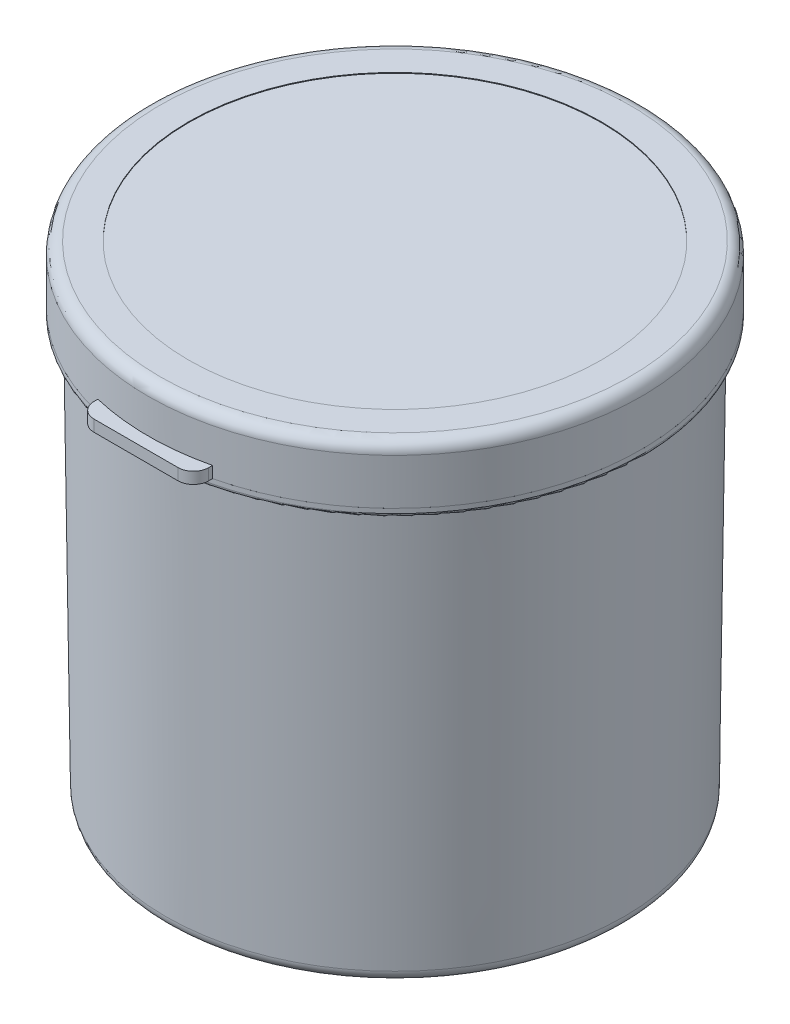
ISO-10303-21;
HEADER;
FILE_DESCRIPTION(('STEP AP214'),'2;1');
FILE_NAME('part.step','',(''),(''),'','','');
FILE_SCHEMA(('AUTOMOTIVE_DESIGN { 1 0 10303 214 1 1 1 1 }'));
ENDSEC;
DATA;
#1=APPLICATION_CONTEXT('core data for automotive mechanical design processes');
#2=APPLICATION_PROTOCOL_DEFINITION('international standard','automotive_design',2000,#1);
#3=PRODUCT_CONTEXT('',#1,'mechanical');
#4=PRODUCT('Part','Part','',(#3));
#5=PRODUCT_RELATED_PRODUCT_CATEGORY('part','',(#4));
#6=PRODUCT_DEFINITION_FORMATION('','',#4);
#7=PRODUCT_DEFINITION_CONTEXT('part definition',#1,'design');
#8=PRODUCT_DEFINITION('design','',#6,#7);
#9=PRODUCT_DEFINITION_SHAPE('','',#8);
#10=(LENGTH_UNIT() NAMED_UNIT(*) SI_UNIT(.MILLI.,.METRE.));
#11=(NAMED_UNIT(*) PLANE_ANGLE_UNIT() SI_UNIT($,.RADIAN.));
#12=(NAMED_UNIT(*) SI_UNIT($,.STERADIAN.) SOLID_ANGLE_UNIT());
#13=UNCERTAINTY_MEASURE_WITH_UNIT(LENGTH_MEASURE(1.E-05),#10,'distance_accuracy_value','');
#14=(GEOMETRIC_REPRESENTATION_CONTEXT(3) GLOBAL_UNCERTAINTY_ASSIGNED_CONTEXT((#13)) GLOBAL_UNIT_ASSIGNED_CONTEXT((#10,
#11,#12)) REPRESENTATION_CONTEXT('',''));
#15=CARTESIAN_POINT('',(0.,0.,0.));
#16=DIRECTION('',(0.,0.,1.));
#17=DIRECTION('',(1.,0.,0.));
#18=AXIS2_PLACEMENT_3D('',#15,#16,#17);
#19=CARTESIAN_POINT('',(0.,60.5,0.));
#20=DIRECTION('',(0.,1.,0.));
#21=DIRECTION('',(0.,0.,1.));
#22=AXIS2_PLACEMENT_3D('',#19,#20,#21);
#23=PLANE('',#22);
#24=CARTESIAN_POINT('',(0.,60.5,0.));
#25=DIRECTION('',(0.,1.,0.));
#26=DIRECTION('',(0.,0.,1.));
#27=AXIS2_PLACEMENT_3D('',#24,#25,#26);
#28=CIRCLE('',#27,30.6512169002747);
#29=CARTESIAN_POINT('',(0.,60.5,30.6512169002747));
#30=VERTEX_POINT('',#29);
#31=EDGE_CURVE('P0_E24',#30,#30,#28,.T.);
#32=ORIENTED_EDGE('',*,*,#31,.T.);
#33=EDGE_LOOP('',(#32));
#34=FACE_BOUND('',#33,.T.);
#35=CARTESIAN_POINT('',(0.,60.5,0.));
#36=DIRECTION('',(0.,1.,0.));
#37=DIRECTION('',(0.,0.,1.));
#38=AXIS2_PLACEMENT_3D('',#35,#36,#37);
#39=CIRCLE('',#38,29.7499231639382);
#40=CARTESIAN_POINT('',(0.,60.5,29.7499231639382));
#41=VERTEX_POINT('',#40);
#42=EDGE_CURVE('P0_E58',#41,#41,#39,.T.);
#43=ORIENTED_EDGE('',*,*,#42,.F.);
#44=EDGE_LOOP('',(#43));
#45=FACE_BOUND('',#44,.T.);
#46=ADVANCED_FACE('P0_F17',(#34,#45),#23,.T.);
#47=CARTESIAN_POINT('',(0.,0.,0.));
#48=DIRECTION('',(0.,1.,0.));
#49=DIRECTION('',(0.,0.,1.));
#50=AXIS2_PLACEMENT_3D('',#47,#48,#49);
#51=CONICAL_SURFACE('',#50,30.,0.0123960592402527);
#52=CARTESIAN_POINT('',(0.,60.400007683016,0.));
#53=DIRECTION('',(0.,-1.,0.));
#54=DIRECTION('',(0.,0.,-1.));
#55=AXIS2_PLACEMENT_3D('',#52,#53,#54);
#56=CIRCLE('',#55,30.7487604258225);
#57=CARTESIAN_POINT('',(0.,60.400007683016,-30.7487604258225));
#58=VERTEX_POINT('',#57);
#59=EDGE_CURVE('P0_E11',#58,#58,#56,.T.);
#60=ORIENTED_EDGE('',*,*,#59,.T.);
#61=EDGE_LOOP('',(#60));
#62=FACE_BOUND('',#61,.T.);
#63=CARTESIAN_POINT('',(0.,55.5,0.));
#64=DIRECTION('',(0.,1.,0.));
#65=DIRECTION('',(0.,0.,1.));
#66=AXIS2_PLACEMENT_3D('',#63,#64,#65);
#67=CIRCLE('',#66,30.6880165289256);
#68=CARTESIAN_POINT('',(0.,55.5,30.6880165289256));
#69=VERTEX_POINT('',#68);
#70=EDGE_CURVE('P0_E49',#69,#69,#67,.F.);
#71=ORIENTED_EDGE('',*,*,#70,.F.);
#72=EDGE_LOOP('',(#71));
#73=FACE_BOUND('',#72,.T.);
#74=ADVANCED_FACE('P0_F65',(#62,#73),#51,.T.);
#75=CARTESIAN_POINT('',(0.,55.5,0.));
#76=DIRECTION('',(0.,-1.,0.));
#77=DIRECTION('',(0.,0.,-1.));
#78=AXIS2_PLACEMENT_3D('',#75,#76,#77);
#79=CYLINDRICAL_SURFACE('',#78,32.25);
#80=CARTESIAN_POINT('',(0.,54.9,0.));
#81=DIRECTION('',(0.,1.,0.));
#82=DIRECTION('',(0.,0.,1.));
#83=AXIS2_PLACEMENT_3D('',#80,#81,#82);
#84=CIRCLE('',#83,32.25);
#85=CARTESIAN_POINT('',(0.,54.9,32.25));
#86=VERTEX_POINT('',#85);
#87=EDGE_CURVE('P0_E40',#86,#86,#84,.T.);
#88=ORIENTED_EDGE('',*,*,#87,.T.);
#89=EDGE_LOOP('',(#88));
#90=FACE_BOUND('',#89,.T.);
#91=CARTESIAN_POINT('',(0.,55.5,0.));
#92=DIRECTION('',(0.,1.,0.));
#93=DIRECTION('',(0.,0.,1.));
#94=AXIS2_PLACEMENT_3D('',#91,#92,#93);
#95=CIRCLE('',#94,32.25);
#96=CARTESIAN_POINT('',(0.,55.5,32.25));
#97=VERTEX_POINT('',#96);
#98=EDGE_CURVE('P0_E55',#97,#97,#95,.T.);
#99=ORIENTED_EDGE('',*,*,#98,.F.);
#100=EDGE_LOOP('',(#99));
#101=FACE_BOUND('',#100,.T.);
#102=ADVANCED_FACE('P0_F71',(#90,#101),#79,.T.);
#103=CARTESIAN_POINT('',(0.,55.5,0.));
#104=DIRECTION('',(0.,1.,0.));
#105=DIRECTION('',(0.,0.,1.));
#106=AXIS2_PLACEMENT_3D('',#103,#104,#105);
#107=PLANE('',#106);
#108=ORIENTED_EDGE('',*,*,#70,.T.);
#109=EDGE_LOOP('',(#108));
#110=FACE_BOUND('',#109,.T.);
#111=ORIENTED_EDGE('',*,*,#98,.T.);
#112=EDGE_LOOP('',(#111));
#113=FACE_BOUND('',#112,.T.);
#114=ADVANCED_FACE('P0_F102',(#110,#113),#107,.T.);
#115=CARTESIAN_POINT('',(0.,54.4,0.));
#116=DIRECTION('',(0.,1.,0.));
#117=DIRECTION('',(0.,0.,1.));
#118=AXIS2_PLACEMENT_3D('',#115,#116,#117);
#119=PLANE('',#118);
#120=CARTESIAN_POINT('',(0.,54.4,0.));
#121=DIRECTION('',(0.,1.,0.));
#122=DIRECTION('',(0.,0.,1.));
#123=AXIS2_PLACEMENT_3D('',#120,#121,#122);
#124=CIRCLE('',#123,31.75);
#125=CARTESIAN_POINT('',(0.,54.4,31.75));
#126=VERTEX_POINT('',#125);
#127=EDGE_CURVE('P0_E37',#126,#126,#124,.F.);
#128=ORIENTED_EDGE('',*,*,#127,.T.);
#129=EDGE_LOOP('',(#128));
#130=FACE_BOUND('',#129,.T.);
#131=CARTESIAN_POINT('',(0.,54.4,0.));
#132=DIRECTION('',(0.,1.,0.));
#133=DIRECTION('',(0.,0.,1.));
#134=AXIS2_PLACEMENT_3D('',#131,#132,#133);
#135=CIRCLE('',#134,30.6743801652893);
#136=CARTESIAN_POINT('',(0.,54.4,30.6743801652893));
#137=VERTEX_POINT('',#136);
#138=EDGE_CURVE('P0_E52',#137,#137,#135,.F.);
#139=ORIENTED_EDGE('',*,*,#138,.F.);
#140=EDGE_LOOP('',(#139));
#141=FACE_BOUND('',#140,.T.);
#142=ADVANCED_FACE('P0_F100',(#130,#141),#119,.F.);
#143=CARTESIAN_POINT('',(0.,0.,0.));
#144=DIRECTION('',(0.,1.,0.));
#145=DIRECTION('',(0.,0.,1.));
#146=AXIS2_PLACEMENT_3D('',#143,#144,#145);
#147=PLANE('',#146);
#148=CARTESIAN_POINT('',(0.,0.,0.));
#149=DIRECTION('',(0.,1.,0.));
#150=DIRECTION('',(0.,0.,1.));
#151=AXIS2_PLACEMENT_3D('',#148,#149,#150);
#152=CIRCLE('',#151,28.5184797872296);
#153=CARTESIAN_POINT('',(0.,0.,28.5184797872296));
#154=VERTEX_POINT('',#153);
#155=EDGE_CURVE('P0_E28',#154,#154,#152,.F.);
#156=ORIENTED_EDGE('',*,*,#155,.T.);
#157=EDGE_LOOP('',(#156));
#158=FACE_BOUND('',#157,.T.);
#159=ADVANCED_FACE('P0_F97',(#158),#147,.F.);
#160=CARTESIAN_POINT('',(0.,1.48140638733766,0.));
#161=DIRECTION('',(0.,1.,0.));
#162=DIRECTION('',(0.,0.,1.));
#163=AXIS2_PLACEMENT_3D('',#160,#161,#162);
#164=CIRCLE('',#163,30.0183645419918);
#165=CARTESIAN_POINT('',(0.,1.48140638733766,30.0183645419918));
#166=VERTEX_POINT('',#165);
#167=EDGE_CURVE('P0_E32',#166,#166,#164,.T.);
#168=ORIENTED_EDGE('',*,*,#167,.T.);
#169=EDGE_LOOP('',(#168));
#170=FACE_BOUND('',#169,.T.);
#171=ORIENTED_EDGE('',*,*,#138,.T.);
#172=EDGE_LOOP('',(#171));
#173=FACE_BOUND('',#172,.T.);
#174=ADVANCED_FACE('P0_F73',(#170,#173),#51,.T.);
#175=CARTESIAN_POINT('',(0.,0.0123957417748945,0.));
#176=DIRECTION('',(0.,1.,0.));
#177=DIRECTION('',(0.,0.,1.));
#178=AXIS2_PLACEMENT_3D('',#175,#176,#177);
#179=CONICAL_SURFACE('',#178,29.0000768301585,0.0123960592402527);
#180=CARTESIAN_POINT('',(0.,1.49380212911243,0.));
#181=DIRECTION('',(0.,-1.,0.));
#182=DIRECTION('',(0.,0.,-1.));
#183=AXIS2_PLACEMENT_3D('',#180,#181,#182);
#184=CIRCLE('',#183,29.0184413721503);
#185=CARTESIAN_POINT('',(0.,1.49380212911243,-29.0184413721503));
#186=VERTEX_POINT('',#185);
#187=EDGE_CURVE('P0_E43',#186,#186,#184,.T.);
#188=ORIENTED_EDGE('',*,*,#187,.T.);
#189=EDGE_LOOP('',(#188));
#190=FACE_BOUND('',#189,.T.);
#191=ORIENTED_EDGE('',*,*,#42,.T.);
#192=EDGE_LOOP('',(#191));
#193=FACE_BOUND('',#192,.T.);
#194=ADVANCED_FACE('P0_F62',(#190,#193),#179,.F.);
#195=CARTESIAN_POINT('',(0.,1.,0.));
#196=DIRECTION('',(0.,1.,0.));
#197=DIRECTION('',(0.,0.,1.));
#198=AXIS2_PLACEMENT_3D('',#195,#196,#197);
#199=PLANE('',#198);
#200=CARTESIAN_POINT('',(0.,1.,0.));
#201=DIRECTION('',(0.,1.,0.));
#202=DIRECTION('',(0.,0.,1.));
#203=AXIS2_PLACEMENT_3D('',#200,#201,#202);
#204=CIRCLE('',#203,28.5184797872296);
#205=CARTESIAN_POINT('',(0.,1.,28.5184797872296));
#206=VERTEX_POINT('',#205);
#207=EDGE_CURVE('P0_E46',#206,#206,#204,.T.);
#208=ORIENTED_EDGE('',*,*,#207,.T.);
#209=EDGE_LOOP('',(#208));
#210=FACE_BOUND('',#209,.T.);
#211=ADVANCED_FACE('P0_F80',(#210),#199,.T.);
#212=CARTESIAN_POINT('',(0.,1.5,0.));
#213=DIRECTION('',(0.,1.,0.));
#214=DIRECTION('',(0.,0.,1.));
#215=AXIS2_PLACEMENT_3D('',#212,#213,#214);
#216=TOROIDAL_SURFACE('',#215,28.5184797872296,0.5);
#217=ORIENTED_EDGE('',*,*,#187,.F.);
#218=EDGE_LOOP('',(#217));
#219=FACE_BOUND('',#218,.T.);
#220=ORIENTED_EDGE('',*,*,#207,.F.);
#221=EDGE_LOOP('',(#220));
#222=FACE_BOUND('',#221,.T.);
#223=ADVANCED_FACE('P0_F76',(#219,#222),#216,.F.);
#224=CARTESIAN_POINT('',(0.,54.9,0.));
#225=DIRECTION('',(0.,1.,0.));
#226=DIRECTION('',(0.,0.,1.));
#227=AXIS2_PLACEMENT_3D('',#224,#225,#226);
#228=TOROIDAL_SURFACE('',#227,31.75,0.5);
#229=ORIENTED_EDGE('',*,*,#127,.F.);
#230=EDGE_LOOP('',(#229));
#231=FACE_BOUND('',#230,.T.);
#232=ORIENTED_EDGE('',*,*,#87,.F.);
#233=EDGE_LOOP('',(#232));
#234=FACE_BOUND('',#233,.T.);
#235=ADVANCED_FACE('P0_F79',(#231,#234),#228,.T.);
#236=CARTESIAN_POINT('',(0.,1.5,0.));
#237=DIRECTION('',(0.,1.,0.));
#238=DIRECTION('',(0.,0.,1.));
#239=AXIS2_PLACEMENT_3D('',#236,#237,#238);
#240=TOROIDAL_SURFACE('',#239,28.5184797872296,1.5);
#241=ORIENTED_EDGE('',*,*,#155,.F.);
#242=EDGE_LOOP('',(#241));
#243=FACE_BOUND('',#242,.T.);
#244=ORIENTED_EDGE('',*,*,#167,.F.);
#245=EDGE_LOOP('',(#244));
#246=FACE_BOUND('',#245,.T.);
#247=ADVANCED_FACE('P0_F83',(#243,#246),#240,.T.);
#248=CARTESIAN_POINT('',(0.,60.5,0.));
#249=DIRECTION('',(0.,-1.,0.));
#250=DIRECTION('',(0.,0.,-1.));
#251=AXIS2_PLACEMENT_3D('',#248,#249,#250);
#252=CONICAL_SURFACE('',#251,30.6512169002747,0.773002104157183);
#253=ORIENTED_EDGE('',*,*,#59,.F.);
#254=EDGE_LOOP('',(#253));
#255=FACE_BOUND('',#254,.T.);
#256=ORIENTED_EDGE('',*,*,#31,.F.);
#257=EDGE_LOOP('',(#256));
#258=FACE_BOUND('',#257,.T.);
#259=ADVANCED_FACE('P0_F19',(#255,#258),#252,.T.);
#260=CLOSED_SHELL('',(#46,#74,#102,#114,#142,#159,#174,#194,#211,#223,#235,#247,#259));
#261=MANIFOLD_SOLID_BREP('P0_B1',#260);
#262=CARTESIAN_POINT('',(0.,59.5,0.));
#263=DIRECTION('',(0.,1.,0.));
#264=DIRECTION('',(0.,0.,1.));
#265=AXIS2_PLACEMENT_3D('',#262,#263,#264);
#266=PLANE('',#265);
#267=CARTESIAN_POINT('',(0.,59.5,0.));
#268=DIRECTION('',(0.,1.,0.));
#269=DIRECTION('',(0.,0.,1.));
#270=AXIS2_PLACEMENT_3D('',#267,#268,#269);
#271=CIRCLE('',#270,31.05);
#272=CARTESIAN_POINT('',(0.,59.5,31.05));
#273=VERTEX_POINT('',#272);
#274=EDGE_CURVE('P1_E10',#273,#273,#271,.T.);
#275=ORIENTED_EDGE('',*,*,#274,.T.);
#276=EDGE_LOOP('',(#275));
#277=FACE_BOUND('',#276,.T.);
#278=CARTESIAN_POINT('',(0.,59.5,0.));
#279=DIRECTION('',(0.,1.,0.));
#280=DIRECTION('',(0.,0.,1.));
#281=AXIS2_PLACEMENT_3D('',#278,#279,#280);
#282=CIRCLE('',#281,30.75);
#283=CARTESIAN_POINT('',(0.,59.5,30.75));
#284=VERTEX_POINT('',#283);
#285=EDGE_CURVE('P1_E26',#284,#284,#282,.T.);
#286=ORIENTED_EDGE('',*,*,#285,.F.);
#287=EDGE_LOOP('',(#286));
#288=FACE_BOUND('',#287,.T.);
#289=ADVANCED_FACE('P1_F15',(#277,#288),#266,.T.);
#290=CARTESIAN_POINT('',(0.,58.5,0.));
#291=DIRECTION('',(0.,1.,0.));
#292=DIRECTION('',(0.,0.,1.));
#293=AXIS2_PLACEMENT_3D('',#290,#291,#292);
#294=PLANE('',#293);
#295=CARTESIAN_POINT('',(0.,58.5,0.));
#296=DIRECTION('',(0.,1.,0.));
#297=DIRECTION('',(0.,0.,1.));
#298=AXIS2_PLACEMENT_3D('',#295,#296,#297);
#299=CIRCLE('',#298,31.05);
#300=CARTESIAN_POINT('',(0.,58.5,31.05));
#301=VERTEX_POINT('',#300);
#302=EDGE_CURVE('P1_E19',#301,#301,#299,.T.);
#303=ORIENTED_EDGE('',*,*,#302,.F.);
#304=EDGE_LOOP('',(#303));
#305=FACE_BOUND('',#304,.T.);
#306=CARTESIAN_POINT('',(0.,58.5,0.));
#307=DIRECTION('',(0.,1.,0.));
#308=DIRECTION('',(0.,0.,1.));
#309=AXIS2_PLACEMENT_3D('',#306,#307,#308);
#310=CIRCLE('',#309,30.75);
#311=CARTESIAN_POINT('',(0.,58.5,30.75));
#312=VERTEX_POINT('',#311);
#313=EDGE_CURVE('P1_E28',#312,#312,#310,.T.);
#314=ORIENTED_EDGE('',*,*,#313,.T.);
#315=EDGE_LOOP('',(#314));
#316=FACE_BOUND('',#315,.T.);
#317=ADVANCED_FACE('P1_F38',(#305,#316),#294,.F.);
#318=CARTESIAN_POINT('',(0.,59.5,0.));
#319=DIRECTION('',(0.,-1.,0.));
#320=DIRECTION('',(0.,0.,-1.));
#321=AXIS2_PLACEMENT_3D('',#318,#319,#320);
#322=CYLINDRICAL_SURFACE('',#321,31.05);
#323=ORIENTED_EDGE('',*,*,#274,.F.);
#324=EDGE_LOOP('',(#323));
#325=FACE_BOUND('',#324,.T.);
#326=ORIENTED_EDGE('',*,*,#302,.T.);
#327=EDGE_LOOP('',(#326));
#328=FACE_BOUND('',#327,.T.);
#329=ADVANCED_FACE('P1_F17',(#325,#328),#322,.T.);
#330=CARTESIAN_POINT('',(0.,59.5,0.));
#331=DIRECTION('',(0.,-1.,0.));
#332=DIRECTION('',(0.,0.,-1.));
#333=AXIS2_PLACEMENT_3D('',#330,#331,#332);
#334=CYLINDRICAL_SURFACE('',#333,30.75);
#335=ORIENTED_EDGE('',*,*,#285,.T.);
#336=EDGE_LOOP('',(#335));
#337=FACE_BOUND('',#336,.T.);
#338=ORIENTED_EDGE('',*,*,#313,.F.);
#339=EDGE_LOOP('',(#338));
#340=FACE_BOUND('',#339,.T.);
#341=ADVANCED_FACE('P1_F34',(#337,#340),#334,.F.);
#342=CLOSED_SHELL('',(#289,#317,#329,#341));
#343=MANIFOLD_SOLID_BREP('P1_B1',#342);
#344=CARTESIAN_POINT('',(7.,55.5,-31.4));
#345=DIRECTION('',(0.,-1.,0.));
#346=DIRECTION('',(0.,0.,-1.));
#347=AXIS2_PLACEMENT_3D('',#344,#345,#346);
#348=PLANE('',#347);
#349=DIRECTION('',(0.,0.,1.));
#350=VECTOR('',#349,1.);
#351=CARTESIAN_POINT('',(-7.,55.5,-31.4));
#352=LINE('',#351,#350);
#353=CARTESIAN_POINT('',(-7.,55.5,-32.9));
#354=VERTEX_POINT('',#353);
#355=CARTESIAN_POINT('',(-7.,55.5,-31.4));
#356=VERTEX_POINT('',#355);
#357=EDGE_CURVE('P2_E64',#354,#356,#352,.T.);
#358=ORIENTED_EDGE('',*,*,#357,.T.);
#359=DIRECTION('',(-1.,0.,0.));
#360=VECTOR('',#359,1.);
#361=CARTESIAN_POINT('',(7.,55.5,-31.4));
#362=LINE('',#361,#360);
#363=CARTESIAN_POINT('',(7.,55.5,-31.4));
#364=VERTEX_POINT('',#363);
#365=EDGE_CURVE('P2_E11',#364,#356,#362,.T.);
#366=ORIENTED_EDGE('',*,*,#365,.F.);
#367=DIRECTION('',(0.,0.,1.));
#368=VECTOR('',#367,1.);
#369=CARTESIAN_POINT('',(7.,55.5,-31.4));
#370=LINE('',#369,#368);
#371=CARTESIAN_POINT('',(7.,55.5,-32.9));
#372=VERTEX_POINT('',#371);
#373=EDGE_CURVE('P2_E57',#372,#364,#370,.T.);
#374=ORIENTED_EDGE('',*,*,#373,.F.);
#375=DIRECTION('',(-1.,0.,0.));
#376=VECTOR('',#375,1.);
#377=CARTESIAN_POINT('',(7.,55.5,-32.9));
#378=LINE('',#377,#376);
#379=EDGE_CURVE('P2_E65',#372,#354,#378,.T.);
#380=ORIENTED_EDGE('',*,*,#379,.T.);
#381=EDGE_LOOP('',(#358,#366,#374,#380));
#382=FACE_BOUND('',#381,.T.);
#383=ADVANCED_FACE('P2_F17',(#382),#348,.F.);
#384=CARTESIAN_POINT('',(7.,55.5,-31.4));
#385=DIRECTION('',(0.,0.,-1.));
#386=DIRECTION('',(-1.,0.,0.));
#387=AXIS2_PLACEMENT_3D('',#384,#385,#386);
#388=PLANE('',#387);
#389=DIRECTION('',(0.,-1.,0.));
#390=VECTOR('',#389,1.);
#391=CARTESIAN_POINT('',(-7.,55.5,-31.4));
#392=LINE('',#391,#390);
#393=CARTESIAN_POINT('',(-7.,54.6339745962156,-31.4));
#394=VERTEX_POINT('',#393);
#395=EDGE_CURVE('P2_E45',#356,#394,#392,.T.);
#396=ORIENTED_EDGE('',*,*,#395,.T.);
#397=DIRECTION('',(-1.,0.,0.));
#398=VECTOR('',#397,1.);
#399=CARTESIAN_POINT('',(7.,54.6339745962156,-31.4));
#400=LINE('',#399,#398);
#401=CARTESIAN_POINT('',(7.,54.6339745962156,-31.4));
#402=VERTEX_POINT('',#401);
#403=EDGE_CURVE('P2_E25',#402,#394,#400,.T.);
#404=ORIENTED_EDGE('',*,*,#403,.F.);
#405=DIRECTION('',(0.,-1.,0.));
#406=VECTOR('',#405,1.);
#407=CARTESIAN_POINT('',(7.,55.5,-31.4));
#408=LINE('',#407,#406);
#409=EDGE_CURVE('P2_E53',#364,#402,#408,.T.);
#410=ORIENTED_EDGE('',*,*,#409,.F.);
#411=ORIENTED_EDGE('',*,*,#365,.T.);
#412=EDGE_LOOP('',(#396,#404,#410,#411));
#413=FACE_BOUND('',#412,.T.);
#414=ADVANCED_FACE('P2_F54',(#413),#388,.F.);
#415=CARTESIAN_POINT('',(7.,55.5,-32.9));
#416=DIRECTION('',(0.,0.866025403784441,0.499999999999995));
#417=DIRECTION('',(0.,-0.499999999999996,0.866025403784441));
#418=AXIS2_PLACEMENT_3D('',#415,#416,#417);
#419=PLANE('',#418);
#420=DIRECTION('',(0.,0.499999999999996,-0.866025403784441));
#421=VECTOR('',#420,1.);
#422=CARTESIAN_POINT('',(-7.,55.5,-32.9));
#423=LINE('',#422,#421);
#424=EDGE_CURVE('P2_E50',#394,#354,#423,.T.);
#425=ORIENTED_EDGE('',*,*,#424,.T.);
#426=ORIENTED_EDGE('',*,*,#379,.F.);
#427=DIRECTION('',(0.,0.499999999999996,-0.866025403784441));
#428=VECTOR('',#427,1.);
#429=CARTESIAN_POINT('',(7.,55.5,-32.9));
#430=LINE('',#429,#428);
#431=EDGE_CURVE('P2_E33',#402,#372,#430,.T.);
#432=ORIENTED_EDGE('',*,*,#431,.F.);
#433=ORIENTED_EDGE('',*,*,#403,.T.);
#434=EDGE_LOOP('',(#425,#426,#432,#433));
#435=FACE_BOUND('',#434,.T.);
#436=ADVANCED_FACE('P2_F72',(#435),#419,.F.);
#437=CARTESIAN_POINT('',(7.,0.,0.));
#438=DIRECTION('',(-1.,0.,0.));
#439=DIRECTION('',(0.,0.,1.));
#440=AXIS2_PLACEMENT_3D('',#437,#438,#439);
#441=PLANE('',#440);
#442=ORIENTED_EDGE('',*,*,#373,.T.);
#443=ORIENTED_EDGE('',*,*,#409,.T.);
#444=ORIENTED_EDGE('',*,*,#431,.T.);
#445=EDGE_LOOP('',(#442,#443,#444));
#446=FACE_BOUND('',#445,.T.);
#447=ADVANCED_FACE('P2_F60',(#446),#441,.F.);
#448=CARTESIAN_POINT('',(-7.,0.,0.));
#449=DIRECTION('',(-1.,0.,0.));
#450=DIRECTION('',(0.,0.,1.));
#451=AXIS2_PLACEMENT_3D('',#448,#449,#450);
#452=PLANE('',#451);
#453=ORIENTED_EDGE('',*,*,#357,.F.);
#454=ORIENTED_EDGE('',*,*,#424,.F.);
#455=ORIENTED_EDGE('',*,*,#395,.F.);
#456=EDGE_LOOP('',(#453,#454,#455));
#457=FACE_BOUND('',#456,.T.);
#458=ADVANCED_FACE('P2_F73',(#457),#452,.T.);
#459=CLOSED_SHELL('',(#383,#414,#436,#447,#458));
#460=MANIFOLD_SOLID_BREP('P2_B1',#459);
#461=CARTESIAN_POINT('',(7.,56.3660254037844,-31.4));
#462=DIRECTION('',(0.,0.,-1.));
#463=DIRECTION('',(-1.,0.,0.));
#464=AXIS2_PLACEMENT_3D('',#461,#462,#463);
#465=PLANE('',#464);
#466=DIRECTION('',(0.,-1.,0.));
#467=VECTOR('',#466,1.);
#468=CARTESIAN_POINT('',(-7.,56.3660254037844,-31.4));
#469=LINE('',#468,#467);
#470=CARTESIAN_POINT('',(-7.,56.3660254037844,-31.4));
#471=VERTEX_POINT('',#470);
#472=CARTESIAN_POINT('',(-7.,55.5,-31.4));
#473=VERTEX_POINT('',#472);
#474=EDGE_CURVE('P3_E64',#471,#473,#469,.T.);
#475=ORIENTED_EDGE('',*,*,#474,.T.);
#476=DIRECTION('',(-1.,0.,0.));
#477=VECTOR('',#476,1.);
#478=CARTESIAN_POINT('',(7.,55.5,-31.4));
#479=LINE('',#478,#477);
#480=CARTESIAN_POINT('',(7.,55.5,-31.4));
#481=VERTEX_POINT('',#480);
#482=EDGE_CURVE('P3_E11',#481,#473,#479,.T.);
#483=ORIENTED_EDGE('',*,*,#482,.F.);
#484=DIRECTION('',(0.,-1.,0.));
#485=VECTOR('',#484,1.);
#486=CARTESIAN_POINT('',(7.,56.3660254037844,-31.4));
#487=LINE('',#486,#485);
#488=CARTESIAN_POINT('',(7.,56.3660254037844,-31.4));
#489=VERTEX_POINT('',#488);
#490=EDGE_CURVE('P3_E57',#489,#481,#487,.T.);
#491=ORIENTED_EDGE('',*,*,#490,.F.);
#492=DIRECTION('',(-1.,0.,0.));
#493=VECTOR('',#492,1.);
#494=CARTESIAN_POINT('',(7.,56.3660254037844,-31.4));
#495=LINE('',#494,#493);
#496=EDGE_CURVE('P3_E65',#489,#471,#495,.T.);
#497=ORIENTED_EDGE('',*,*,#496,.T.);
#498=EDGE_LOOP('',(#475,#483,#491,#497));
#499=FACE_BOUND('',#498,.T.);
#500=ADVANCED_FACE('P3_F17',(#499),#465,.F.);
#501=CARTESIAN_POINT('',(7.,55.5,-31.4));
#502=DIRECTION('',(0.,1.,0.));
#503=DIRECTION('',(0.,0.,1.));
#504=AXIS2_PLACEMENT_3D('',#501,#502,#503);
#505=PLANE('',#504);
#506=DIRECTION('',(0.,0.,-1.));
#507=VECTOR('',#506,1.);
#508=CARTESIAN_POINT('',(-7.,55.5,-31.4));
#509=LINE('',#508,#507);
#510=CARTESIAN_POINT('',(-7.,55.5,-32.9));
#511=VERTEX_POINT('',#510);
#512=EDGE_CURVE('P3_E45',#473,#511,#509,.T.);
#513=ORIENTED_EDGE('',*,*,#512,.T.);
#514=DIRECTION('',(-1.,0.,0.));
#515=VECTOR('',#514,1.);
#516=CARTESIAN_POINT('',(7.,55.5,-32.9));
#517=LINE('',#516,#515);
#518=CARTESIAN_POINT('',(7.,55.5,-32.9));
#519=VERTEX_POINT('',#518);
#520=EDGE_CURVE('P3_E25',#519,#511,#517,.T.);
#521=ORIENTED_EDGE('',*,*,#520,.F.);
#522=DIRECTION('',(0.,0.,-1.));
#523=VECTOR('',#522,1.);
#524=CARTESIAN_POINT('',(7.,55.5,-31.4));
#525=LINE('',#524,#523);
#526=EDGE_CURVE('P3_E53',#481,#519,#525,.T.);
#527=ORIENTED_EDGE('',*,*,#526,.F.);
#528=ORIENTED_EDGE('',*,*,#482,.T.);
#529=EDGE_LOOP('',(#513,#521,#527,#528));
#530=FACE_BOUND('',#529,.T.);
#531=ADVANCED_FACE('P3_F54',(#530),#505,.F.);
#532=CARTESIAN_POINT('',(7.,55.5,-32.9));
#533=DIRECTION('',(0.,-0.866025403784442,0.499999999999995));
#534=DIRECTION('',(0.,-0.499999999999995,-0.866025403784442));
#535=AXIS2_PLACEMENT_3D('',#532,#533,#534);
#536=PLANE('',#535);
#537=DIRECTION('',(0.,0.499999999999995,0.866025403784442));
#538=VECTOR('',#537,1.);
#539=CARTESIAN_POINT('',(-7.,55.5,-32.9));
#540=LINE('',#539,#538);
#541=EDGE_CURVE('P3_E50',#511,#471,#540,.T.);
#542=ORIENTED_EDGE('',*,*,#541,.T.);
#543=ORIENTED_EDGE('',*,*,#496,.F.);
#544=DIRECTION('',(0.,0.499999999999995,0.866025403784442));
#545=VECTOR('',#544,1.);
#546=CARTESIAN_POINT('',(7.,55.5,-32.9));
#547=LINE('',#546,#545);
#548=EDGE_CURVE('P3_E33',#519,#489,#547,.T.);
#549=ORIENTED_EDGE('',*,*,#548,.F.);
#550=ORIENTED_EDGE('',*,*,#520,.T.);
#551=EDGE_LOOP('',(#542,#543,#549,#550));
#552=FACE_BOUND('',#551,.T.);
#553=ADVANCED_FACE('P3_F72',(#552),#536,.F.);
#554=CARTESIAN_POINT('',(7.,55.5,0.));
#555=DIRECTION('',(1.,0.,0.));
#556=DIRECTION('',(0.,0.,-1.));
#557=AXIS2_PLACEMENT_3D('',#554,#555,#556);
#558=PLANE('',#557);
#559=ORIENTED_EDGE('',*,*,#490,.T.);
#560=ORIENTED_EDGE('',*,*,#526,.T.);
#561=ORIENTED_EDGE('',*,*,#548,.T.);
#562=EDGE_LOOP('',(#559,#560,#561));
#563=FACE_BOUND('',#562,.T.);
#564=ADVANCED_FACE('P3_F60',(#563),#558,.T.);
#565=CARTESIAN_POINT('',(-7.,55.5,0.));
#566=DIRECTION('',(1.,0.,0.));
#567=DIRECTION('',(0.,0.,-1.));
#568=AXIS2_PLACEMENT_3D('',#565,#566,#567);
#569=PLANE('',#568);
#570=ORIENTED_EDGE('',*,*,#474,.F.);
#571=ORIENTED_EDGE('',*,*,#541,.F.);
#572=ORIENTED_EDGE('',*,*,#512,.F.);
#573=EDGE_LOOP('',(#570,#571,#572));
#574=FACE_BOUND('',#573,.T.);
#575=ADVANCED_FACE('P3_F73',(#574),#569,.F.);
#576=CLOSED_SHELL('',(#500,#531,#553,#564,#575));
#577=MANIFOLD_SOLID_BREP('P3_B1',#576);
#578=CARTESIAN_POINT('',(0.,63.,0.));
#579=DIRECTION('',(0.,-1.,0.));
#580=DIRECTION('',(0.,0.,-1.));
#581=AXIS2_PLACEMENT_3D('',#578,#579,#580);
#582=CYLINDRICAL_SURFACE('',#581,32.25);
#583=CARTESIAN_POINT('',(0.,61.5,0.));
#584=DIRECTION('',(0.,1.,0.));
#585=DIRECTION('',(0.,0.,1.));
#586=AXIS2_PLACEMENT_3D('',#583,#584,#585);
#587=CIRCLE('',#586,32.25);
#588=CARTESIAN_POINT('',(0.,61.5,32.25));
#589=VERTEX_POINT('',#588);
#590=EDGE_CURVE('P4_E126',#589,#589,#587,.F.);
#591=ORIENTED_EDGE('',*,*,#590,.T.);
#592=EDGE_LOOP('',(#591));
#593=FACE_BOUND('',#592,.T.);
#594=DIRECTION('',(0.,-1.,0.));
#595=VECTOR('',#594,1.);
#596=CARTESIAN_POINT('',(-7.5,57.,31.3657854994897));
#597=LINE('',#596,#595);
#598=CARTESIAN_POINT('',(-7.49999999999999,57.,31.3657854994897));
#599=VERTEX_POINT('',#598);
#600=CARTESIAN_POINT('',(-7.49999999999999,55.5,31.3657854994897));
#601=VERTEX_POINT('',#600);
#602=EDGE_CURVE('P4_E100',#599,#601,#597,.T.);
#603=ORIENTED_EDGE('',*,*,#602,.F.);
#604=CARTESIAN_POINT('',(0.,57.,0.));
#605=DIRECTION('',(0.,1.,0.));
#606=DIRECTION('',(0.,0.,1.));
#607=AXIS2_PLACEMENT_3D('',#604,#605,#606);
#608=CIRCLE('',#607,32.25);
#609=CARTESIAN_POINT('',(7.49999999999999,57.,31.3657854994897));
#610=VERTEX_POINT('',#609);
#611=EDGE_CURVE('P4_E98',#599,#610,#608,.T.);
#612=ORIENTED_EDGE('',*,*,#611,.T.);
#613=DIRECTION('',(0.,-1.,0.));
#614=VECTOR('',#613,1.);
#615=CARTESIAN_POINT('',(7.5,57.,31.3657854994897));
#616=LINE('',#615,#614);
#617=CARTESIAN_POINT('',(7.5,55.5,31.3657854994897));
#618=VERTEX_POINT('',#617);
#619=EDGE_CURVE('P4_E79',#610,#618,#616,.T.);
#620=ORIENTED_EDGE('',*,*,#619,.T.);
#621=CARTESIAN_POINT('',(0.,55.5,0.));
#622=DIRECTION('',(0.,1.,0.));
#623=DIRECTION('',(0.,0.,1.));
#624=AXIS2_PLACEMENT_3D('',#621,#622,#623);
#625=CIRCLE('',#624,32.25);
#626=EDGE_CURVE('P4_E87',#618,#601,#625,.T.);
#627=ORIENTED_EDGE('',*,*,#626,.T.);
#628=EDGE_LOOP('',(#603,#612,#620,#627));
#629=FACE_BOUND('',#628,.T.);
#630=ADVANCED_FACE('P4_F18',(#593,#629),#582,.T.);
#631=CARTESIAN_POINT('',(0.,63.,0.));
#632=DIRECTION('',(0.,1.,0.));
#633=DIRECTION('',(0.,0.,1.));
#634=AXIS2_PLACEMENT_3D('',#631,#632,#633);
#635=PLANE('',#634);
#636=CARTESIAN_POINT('',(0.,63.,0.));
#637=DIRECTION('',(0.,1.,0.));
#638=DIRECTION('',(0.,0.,1.));
#639=AXIS2_PLACEMENT_3D('',#636,#637,#638);
#640=CIRCLE('',#639,30.75);
#641=CARTESIAN_POINT('',(0.,63.,30.75));
#642=VERTEX_POINT('',#641);
#643=EDGE_CURVE('P4_E123',#642,#642,#640,.T.);
#644=ORIENTED_EDGE('',*,*,#643,.T.);
#645=EDGE_LOOP('',(#644));
#646=FACE_BOUND('',#645,.T.);
#647=CARTESIAN_POINT('',(0.,63.,0.));
#648=DIRECTION('',(0.,1.,0.));
#649=DIRECTION('',(0.,0.,1.));
#650=AXIS2_PLACEMENT_3D('',#647,#648,#649);
#651=CIRCLE('',#650,27.);
#652=CARTESIAN_POINT('',(0.,63.,27.));
#653=VERTEX_POINT('',#652);
#654=EDGE_CURVE('P4_E99',#653,#653,#651,.T.);
#655=ORIENTED_EDGE('',*,*,#654,.F.);
#656=EDGE_LOOP('',(#655));
#657=FACE_BOUND('',#656,.T.);
#658=ADVANCED_FACE('P4_F171',(#646,#657),#635,.T.);
#659=CARTESIAN_POINT('',(0.,55.5,0.));
#660=DIRECTION('',(0.,1.,0.));
#661=DIRECTION('',(0.,0.,1.));
#662=AXIS2_PLACEMENT_3D('',#659,#660,#661);
#663=PLANE('',#662);
#664=DIRECTION('',(0.,0.,-1.));
#665=VECTOR('',#664,1.);
#666=CARTESIAN_POINT('',(7.5,55.5,31.3657854994897));
#667=LINE('',#666,#665);
#668=CARTESIAN_POINT('',(7.5,55.5,31.8657854994897));
#669=VERTEX_POINT('',#668);
#670=EDGE_CURVE('P4_E74',#669,#618,#667,.T.);
#671=ORIENTED_EDGE('',*,*,#670,.F.);
#672=CARTESIAN_POINT('',(5.5,55.5,31.8657854994897));
#673=DIRECTION('',(0.,1.,0.));
#674=DIRECTION('',(0.,0.,1.));
#675=AXIS2_PLACEMENT_3D('',#672,#673,#674);
#676=CIRCLE('',#675,2.);
#677=CARTESIAN_POINT('',(5.5,55.5,33.8657854994897));
#678=VERTEX_POINT('',#677);
#679=EDGE_CURVE('P4_E133',#669,#678,#676,.F.);
#680=ORIENTED_EDGE('',*,*,#679,.T.);
#681=DIRECTION('',(1.,0.,0.));
#682=VECTOR('',#681,1.);
#683=CARTESIAN_POINT('',(-7.5,55.5,33.8657854994897));
#684=LINE('',#683,#682);
#685=CARTESIAN_POINT('',(-5.5,55.5,33.8657854994897));
#686=VERTEX_POINT('',#685);
#687=EDGE_CURVE('P4_E84',#686,#678,#684,.T.);
#688=ORIENTED_EDGE('',*,*,#687,.F.);
#689=CARTESIAN_POINT('',(-5.5,55.5,31.8657854994897));
#690=DIRECTION('',(0.,1.,0.));
#691=DIRECTION('',(0.,0.,1.));
#692=AXIS2_PLACEMENT_3D('',#689,#690,#691);
#693=CIRCLE('',#692,2.);
#694=CARTESIAN_POINT('',(-7.5,55.5,31.8657854994897));
#695=VERTEX_POINT('',#694);
#696=EDGE_CURVE('P4_E131',#686,#695,#693,.F.);
#697=ORIENTED_EDGE('',*,*,#696,.T.);
#698=DIRECTION('',(0.,0.,1.));
#699=VECTOR('',#698,1.);
#700=CARTESIAN_POINT('',(-7.5,55.5,31.3657854994897));
#701=LINE('',#700,#699);
#702=EDGE_CURVE('P4_E90',#601,#695,#701,.T.);
#703=ORIENTED_EDGE('',*,*,#702,.F.);
#704=ORIENTED_EDGE('',*,*,#626,.F.);
#705=EDGE_LOOP('',(#671,#680,#688,#697,#703,#704));
#706=FACE_BOUND('',#705,.T.);
#707=CARTESIAN_POINT('',(0.,55.5,0.));
#708=DIRECTION('',(0.,-1.,0.));
#709=DIRECTION('',(0.,0.,-1.));
#710=AXIS2_PLACEMENT_3D('',#707,#708,#709);
#711=CIRCLE('',#710,31.25);
#712=CARTESIAN_POINT('',(0.,55.5,-31.25));
#713=VERTEX_POINT('',#712);
#714=EDGE_CURVE('P4_E109',#713,#713,#711,.T.);
#715=ORIENTED_EDGE('',*,*,#714,.F.);
#716=EDGE_LOOP('',(#715));
#717=FACE_BOUND('',#716,.T.);
#718=ADVANCED_FACE('P4_F88',(#706,#717),#663,.F.);
#719=CARTESIAN_POINT('',(0.,57.,0.));
#720=DIRECTION('',(0.,-1.,0.));
#721=DIRECTION('',(0.,0.,-1.));
#722=AXIS2_PLACEMENT_3D('',#719,#720,#721);
#723=CYLINDRICAL_SURFACE('',#722,31.25);
#724=CARTESIAN_POINT('',(0.,57.,0.));
#725=DIRECTION('',(0.,-1.,0.));
#726=DIRECTION('',(0.,0.,-1.));
#727=AXIS2_PLACEMENT_3D('',#724,#725,#726);
#728=CIRCLE('',#727,31.25);
#729=CARTESIAN_POINT('',(0.,57.,-31.25));
#730=VERTEX_POINT('',#729);
#731=EDGE_CURVE('P4_E111',#730,#730,#728,.T.);
#732=ORIENTED_EDGE('',*,*,#731,.F.);
#733=EDGE_LOOP('',(#732));
#734=FACE_BOUND('',#733,.T.);
#735=ORIENTED_EDGE('',*,*,#714,.T.);
#736=EDGE_LOOP('',(#735));
#737=FACE_BOUND('',#736,.T.);
#738=ADVANCED_FACE('P4_F269',(#734,#737),#723,.F.);
#739=CARTESIAN_POINT('',(0.,57.,0.));
#740=DIRECTION('',(0.,-1.,0.));
#741=DIRECTION('',(0.,0.,-1.));
#742=AXIS2_PLACEMENT_3D('',#739,#740,#741);
#743=PLANE('',#742);
#744=CARTESIAN_POINT('',(0.,57.,0.));
#745=DIRECTION('',(0.,-1.,0.));
#746=DIRECTION('',(0.,0.,-1.));
#747=AXIS2_PLACEMENT_3D('',#744,#745,#746);
#748=CIRCLE('',#747,31.05);
#749=CARTESIAN_POINT('',(0.,57.,-31.05));
#750=VERTEX_POINT('',#749);
#751=EDGE_CURVE('P4_E94',#750,#750,#748,.T.);
#752=ORIENTED_EDGE('',*,*,#751,.F.);
#753=EDGE_LOOP('',(#752));
#754=FACE_BOUND('',#753,.T.);
#755=ORIENTED_EDGE('',*,*,#731,.T.);
#756=EDGE_LOOP('',(#755));
#757=FACE_BOUND('',#756,.T.);
#758=ADVANCED_FACE('P4_F259',(#754,#757),#743,.T.);
#759=CARTESIAN_POINT('',(0.,61.8,0.));
#760=DIRECTION('',(0.,1.,0.));
#761=DIRECTION('',(0.,0.,1.));
#762=AXIS2_PLACEMENT_3D('',#759,#760,#761);
#763=PLANE('',#762);
#764=CARTESIAN_POINT('',(0.,61.8,0.));
#765=DIRECTION('',(0.,1.,0.));
#766=DIRECTION('',(0.,0.,1.));
#767=AXIS2_PLACEMENT_3D('',#764,#765,#766);
#768=CIRCLE('',#767,30.55);
#769=CARTESIAN_POINT('',(0.,61.8,30.55));
#770=VERTEX_POINT('',#769);
#771=EDGE_CURVE('P4_E120',#770,#770,#768,.F.);
#772=ORIENTED_EDGE('',*,*,#771,.T.);
#773=EDGE_LOOP('',(#772));
#774=FACE_BOUND('',#773,.T.);
#775=ADVANCED_FACE('P4_F249',(#774),#763,.F.);
#776=CARTESIAN_POINT('',(0.,63.,0.));
#777=DIRECTION('',(0.,-1.,0.));
#778=DIRECTION('',(0.,0.,-1.));
#779=AXIS2_PLACEMENT_3D('',#776,#777,#778);
#780=CYLINDRICAL_SURFACE('',#779,31.05);
#781=CARTESIAN_POINT('',(0.,61.3,0.));
#782=DIRECTION('',(0.,1.,0.));
#783=DIRECTION('',(0.,0.,1.));
#784=AXIS2_PLACEMENT_3D('',#781,#782,#783);
#785=CIRCLE('',#784,31.05);
#786=CARTESIAN_POINT('',(0.,61.3,31.05));
#787=VERTEX_POINT('',#786);
#788=EDGE_CURVE('P4_E93',#787,#787,#785,.T.);
#789=ORIENTED_EDGE('',*,*,#788,.T.);
#790=EDGE_LOOP('',(#789));
#791=FACE_BOUND('',#790,.T.);
#792=ORIENTED_EDGE('',*,*,#751,.T.);
#793=EDGE_LOOP('',(#792));
#794=FACE_BOUND('',#793,.T.);
#795=ADVANCED_FACE('P4_F239',(#791,#794),#780,.F.);
#796=CARTESIAN_POINT('',(0.,62.9,0.));
#797=DIRECTION('',(0.,1.,0.));
#798=DIRECTION('',(0.,0.,1.));
#799=AXIS2_PLACEMENT_3D('',#796,#797,#798);
#800=CYLINDRICAL_SURFACE('',#799,27.);
#801=CARTESIAN_POINT('',(0.,62.9,0.));
#802=DIRECTION('',(0.,1.,0.));
#803=DIRECTION('',(0.,0.,1.));
#804=AXIS2_PLACEMENT_3D('',#801,#802,#803);
#805=CIRCLE('',#804,27.);
#806=CARTESIAN_POINT('',(0.,62.9,27.));
#807=VERTEX_POINT('',#806);
#808=EDGE_CURVE('P4_E103',#807,#807,#805,.T.);
#809=ORIENTED_EDGE('',*,*,#808,.F.);
#810=EDGE_LOOP('',(#809));
#811=FACE_BOUND('',#810,.T.);
#812=ORIENTED_EDGE('',*,*,#654,.T.);
#813=EDGE_LOOP('',(#812));
#814=FACE_BOUND('',#813,.T.);
#815=ADVANCED_FACE('P4_F230',(#811,#814),#800,.F.);
#816=CARTESIAN_POINT('',(0.,62.9,0.));
#817=DIRECTION('',(0.,1.,0.));
#818=DIRECTION('',(0.,0.,1.));
#819=AXIS2_PLACEMENT_3D('',#816,#817,#818);
#820=PLANE('',#819);
#821=ORIENTED_EDGE('',*,*,#808,.T.);
#822=EDGE_LOOP('',(#821));
#823=FACE_BOUND('',#822,.T.);
#824=ADVANCED_FACE('P4_F182',(#823),#820,.T.);
#825=CARTESIAN_POINT('',(0.,61.3,0.));
#826=DIRECTION('',(0.,1.,0.));
#827=DIRECTION('',(0.,0.,1.));
#828=AXIS2_PLACEMENT_3D('',#825,#826,#827);
#829=TOROIDAL_SURFACE('',#828,30.55,0.5);
#830=ORIENTED_EDGE('',*,*,#771,.F.);
#831=EDGE_LOOP('',(#830));
#832=FACE_BOUND('',#831,.T.);
#833=ORIENTED_EDGE('',*,*,#788,.F.);
#834=EDGE_LOOP('',(#833));
#835=FACE_BOUND('',#834,.T.);
#836=ADVANCED_FACE('P4_F166',(#832,#835),#829,.F.);
#837=CARTESIAN_POINT('',(0.,61.5,0.));
#838=DIRECTION('',(0.,1.,0.));
#839=DIRECTION('',(0.,0.,1.));
#840=AXIS2_PLACEMENT_3D('',#837,#838,#839);
#841=TOROIDAL_SURFACE('',#840,30.75,1.5);
#842=ORIENTED_EDGE('',*,*,#590,.F.);
#843=EDGE_LOOP('',(#842));
#844=FACE_BOUND('',#843,.T.);
#845=ORIENTED_EDGE('',*,*,#643,.F.);
#846=EDGE_LOOP('',(#845));
#847=FACE_BOUND('',#846,.T.);
#848=ADVANCED_FACE('P4_F158',(#844,#847),#841,.T.);
#849=CARTESIAN_POINT('',(-7.5,57.,31.3657854994897));
#850=DIRECTION('',(1.,0.,0.));
#851=DIRECTION('',(0.,0.,-1.));
#852=AXIS2_PLACEMENT_3D('',#849,#850,#851);
#853=PLANE('',#852);
#854=ORIENTED_EDGE('',*,*,#702,.T.);
#855=DIRECTION('',(0.,-1.,0.));
#856=VECTOR('',#855,1.);
#857=CARTESIAN_POINT('',(-7.5,57.,31.8657854994897));
#858=LINE('',#857,#856);
#859=CARTESIAN_POINT('',(-7.5,57.,31.8657854994897));
#860=VERTEX_POINT('',#859);
#861=EDGE_CURVE('P4_E11',#695,#860,#858,.F.);
#862=ORIENTED_EDGE('',*,*,#861,.T.);
#863=DIRECTION('',(0.,0.,1.));
#864=VECTOR('',#863,1.);
#865=CARTESIAN_POINT('',(-7.5,57.,31.3657854994897));
#866=LINE('',#865,#864);
#867=EDGE_CURVE('P4_E83',#599,#860,#866,.T.);
#868=ORIENTED_EDGE('',*,*,#867,.F.);
#869=ORIENTED_EDGE('',*,*,#602,.T.);
#870=EDGE_LOOP('',(#854,#862,#868,#869));
#871=FACE_BOUND('',#870,.T.);
#872=ADVANCED_FACE('P4_F156',(#871),#853,.F.);
#873=CARTESIAN_POINT('',(-7.5,57.,33.8657854994897));
#874=DIRECTION('',(0.,0.,-1.));
#875=DIRECTION('',(-1.,0.,0.));
#876=AXIS2_PLACEMENT_3D('',#873,#874,#875);
#877=PLANE('',#876);
#878=ORIENTED_EDGE('',*,*,#687,.T.);
#879=DIRECTION('',(0.,-1.,0.));
#880=VECTOR('',#879,1.);
#881=CARTESIAN_POINT('',(5.5,57.,33.8657854994897));
#882=LINE('',#881,#880);
#883=CARTESIAN_POINT('',(5.5,57.,33.8657854994897));
#884=VERTEX_POINT('',#883);
#885=EDGE_CURVE('P4_E39',#678,#884,#882,.F.);
#886=ORIENTED_EDGE('',*,*,#885,.T.);
#887=DIRECTION('',(1.,0.,0.));
#888=VECTOR('',#887,1.);
#889=CARTESIAN_POINT('',(-7.5,57.,33.8657854994897));
#890=LINE('',#889,#888);
#891=CARTESIAN_POINT('',(-5.5,57.,33.8657854994897));
#892=VERTEX_POINT('',#891);
#893=EDGE_CURVE('P4_E143',#892,#884,#890,.T.);
#894=ORIENTED_EDGE('',*,*,#893,.F.);
#895=DIRECTION('',(0.,-1.,0.));
#896=VECTOR('',#895,1.);
#897=CARTESIAN_POINT('',(-5.5,57.,33.8657854994897));
#898=LINE('',#897,#896);
#899=EDGE_CURVE('P4_E135',#892,#686,#898,.T.);
#900=ORIENTED_EDGE('',*,*,#899,.T.);
#901=EDGE_LOOP('',(#878,#886,#894,#900));
#902=FACE_BOUND('',#901,.T.);
#903=ADVANCED_FACE('P4_F148',(#902),#877,.F.);
#904=CARTESIAN_POINT('',(7.5,57.,31.3657854994897));
#905=DIRECTION('',(-1.,0.,0.));
#906=DIRECTION('',(0.,0.,1.));
#907=AXIS2_PLACEMENT_3D('',#904,#905,#906);
#908=PLANE('',#907);
#909=DIRECTION('',(0.,0.,-1.));
#910=VECTOR('',#909,1.);
#911=CARTESIAN_POINT('',(7.5,57.,31.3657854994897));
#912=LINE('',#911,#910);
#913=CARTESIAN_POINT('',(7.5,57.,31.8657854994897));
#914=VERTEX_POINT('',#913);
#915=EDGE_CURVE('P4_E105',#914,#610,#912,.T.);
#916=ORIENTED_EDGE('',*,*,#915,.F.);
#917=DIRECTION('',(0.,-1.,0.));
#918=VECTOR('',#917,1.);
#919=CARTESIAN_POINT('',(7.5,57.,31.8657854994897));
#920=LINE('',#919,#918);
#921=EDGE_CURVE('P4_E81',#914,#669,#920,.T.);
#922=ORIENTED_EDGE('',*,*,#921,.T.);
#923=ORIENTED_EDGE('',*,*,#670,.T.);
#924=ORIENTED_EDGE('',*,*,#619,.F.);
#925=EDGE_LOOP('',(#916,#922,#923,#924));
#926=FACE_BOUND('',#925,.T.);
#927=ADVANCED_FACE('P4_F77',(#926),#908,.F.);
#928=CARTESIAN_POINT('',(0.,57.,0.));
#929=DIRECTION('',(0.,1.,0.));
#930=DIRECTION('',(0.,0.,1.));
#931=AXIS2_PLACEMENT_3D('',#928,#929,#930);
#932=PLANE('',#931);
#933=ORIENTED_EDGE('',*,*,#893,.T.);
#934=CARTESIAN_POINT('',(5.5,57.,31.8657854994897));
#935=DIRECTION('',(0.,1.,0.));
#936=DIRECTION('',(0.,0.,1.));
#937=AXIS2_PLACEMENT_3D('',#934,#935,#936);
#938=CIRCLE('',#937,2.);
#939=EDGE_CURVE('P4_E26',#884,#914,#938,.T.);
#940=ORIENTED_EDGE('',*,*,#939,.T.);
#941=ORIENTED_EDGE('',*,*,#915,.T.);
#942=ORIENTED_EDGE('',*,*,#611,.F.);
#943=ORIENTED_EDGE('',*,*,#867,.T.);
#944=CARTESIAN_POINT('',(-5.5,57.,31.8657854994897));
#945=DIRECTION('',(0.,1.,0.));
#946=DIRECTION('',(0.,0.,1.));
#947=AXIS2_PLACEMENT_3D('',#944,#945,#946);
#948=CIRCLE('',#947,2.);
#949=EDGE_CURVE('P4_E139',#860,#892,#948,.T.);
#950=ORIENTED_EDGE('',*,*,#949,.T.);
#951=EDGE_LOOP('',(#933,#940,#941,#942,#943,#950));
#952=FACE_BOUND('',#951,.T.);
#953=ADVANCED_FACE('P4_F142',(#952),#932,.T.);
#954=CARTESIAN_POINT('',(5.5,57.,31.8657854994897));
#955=DIRECTION('',(0.,-1.,0.));
#956=DIRECTION('',(0.,0.,-1.));
#957=AXIS2_PLACEMENT_3D('',#954,#955,#956);
#958=CYLINDRICAL_SURFACE('',#957,2.);
#959=ORIENTED_EDGE('',*,*,#939,.F.);
#960=ORIENTED_EDGE('',*,*,#885,.F.);
#961=ORIENTED_EDGE('',*,*,#679,.F.);
#962=ORIENTED_EDGE('',*,*,#921,.F.);
#963=EDGE_LOOP('',(#959,#960,#961,#962));
#964=FACE_BOUND('',#963,.T.);
#965=ADVANCED_FACE('P4_F146',(#964),#958,.T.);
#966=CARTESIAN_POINT('',(-5.5,57.,31.8657854994897));
#967=DIRECTION('',(0.,-1.,0.));
#968=DIRECTION('',(0.,0.,-1.));
#969=AXIS2_PLACEMENT_3D('',#966,#967,#968);
#970=CYLINDRICAL_SURFACE('',#969,2.);
#971=ORIENTED_EDGE('',*,*,#949,.F.);
#972=ORIENTED_EDGE('',*,*,#861,.F.);
#973=ORIENTED_EDGE('',*,*,#696,.F.);
#974=ORIENTED_EDGE('',*,*,#899,.F.);
#975=EDGE_LOOP('',(#971,#972,#973,#974));
#976=FACE_BOUND('',#975,.T.);
#977=ADVANCED_FACE('P4_F20',(#976),#970,.T.);
#978=CLOSED_SHELL('',(#630,#658,#718,#738,#758,#775,#795,#815,#824,#836,#848,#872,#903,#927,
#953,#965,#977));
#979=MANIFOLD_SOLID_BREP('P4_B1',#978);
#980=ADVANCED_BREP_SHAPE_REPRESENTATION('',(#18,#261,#343,#460,#577,#979),#14);
#981=SHAPE_DEFINITION_REPRESENTATION(#9,#980);
ENDSEC;
END-ISO-10303-21;
